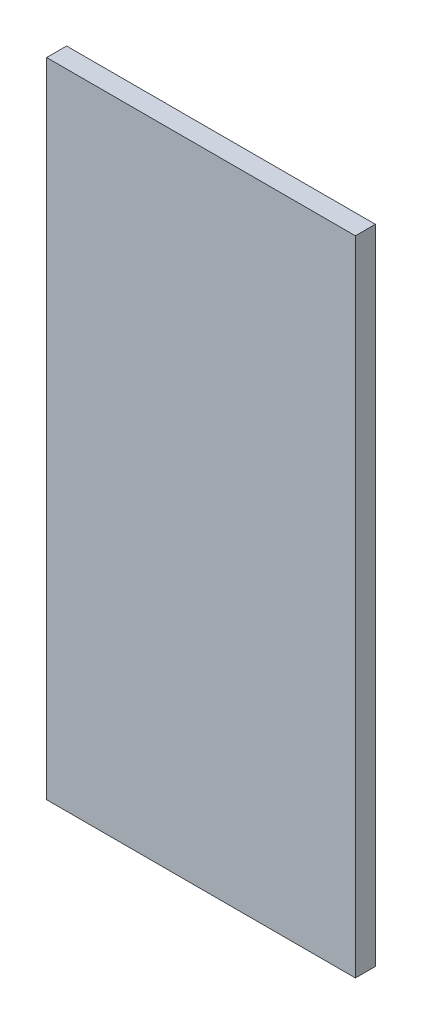
ISO-10303-21;
HEADER;
FILE_DESCRIPTION(('STEP AP214'),'2;1');
FILE_NAME('part.step','',(''),(''),'','','');
FILE_SCHEMA(('AUTOMOTIVE_DESIGN { 1 0 10303 214 1 1 1 1 }'));
ENDSEC;
DATA;
#1=APPLICATION_CONTEXT('core data for automotive mechanical design processes');
#2=APPLICATION_PROTOCOL_DEFINITION('international standard','automotive_design',2000,#1);
#3=PRODUCT_CONTEXT('',#1,'mechanical');
#4=PRODUCT('Part','Part','',(#3));
#5=PRODUCT_RELATED_PRODUCT_CATEGORY('part','',(#4));
#6=PRODUCT_DEFINITION_FORMATION('','',#4);
#7=PRODUCT_DEFINITION_CONTEXT('part definition',#1,'design');
#8=PRODUCT_DEFINITION('design','',#6,#7);
#9=PRODUCT_DEFINITION_SHAPE('','',#8);
#10=(LENGTH_UNIT() NAMED_UNIT(*) SI_UNIT(.MILLI.,.METRE.));
#11=(NAMED_UNIT(*) PLANE_ANGLE_UNIT() SI_UNIT($,.RADIAN.));
#12=(NAMED_UNIT(*) SI_UNIT($,.STERADIAN.) SOLID_ANGLE_UNIT());
#13=UNCERTAINTY_MEASURE_WITH_UNIT(LENGTH_MEASURE(1.E-05),#10,'distance_accuracy_value','');
#14=(GEOMETRIC_REPRESENTATION_CONTEXT(3) GLOBAL_UNCERTAINTY_ASSIGNED_CONTEXT((#13)) GLOBAL_UNIT_ASSIGNED_CONTEXT((#10,
#11,#12)) REPRESENTATION_CONTEXT('',''));
#15=CARTESIAN_POINT('',(0.,0.,0.));
#16=DIRECTION('',(0.,0.,1.));
#17=DIRECTION('',(1.,0.,0.));
#18=AXIS2_PLACEMENT_3D('',#15,#16,#17);
#19=CARTESIAN_POINT('',(87.0419998168945,100.66300201416,0.));
#20=DIRECTION('',(1.,0.,0.));
#21=DIRECTION('',(0.,-1.,0.));
#22=AXIS2_PLACEMENT_3D('',#19,#20,#21);
#23=PLANE('',#22);
#24=DIRECTION('',(0.,-1.,0.));
#25=VECTOR('',#24,1.);
#26=CARTESIAN_POINT('',(87.0419998168945,100.66300201416,0.03556));
#27=LINE('',#26,#25);
#28=CARTESIAN_POINT('',(87.0419998168945,100.66300201416,0.03556));
#29=VERTEX_POINT('',#28);
#30=CARTESIAN_POINT('',(87.0419998168945,99.5179977416992,0.03556));
#31=VERTEX_POINT('',#30);
#32=EDGE_CURVE('E11',#29,#31,#27,.T.);
#33=ORIENTED_EDGE('',*,*,#32,.F.);
#34=DIRECTION('',(0.,0.,1.));
#35=VECTOR('',#34,1.);
#36=CARTESIAN_POINT('',(87.0419998168945,100.66300201416,0.));
#37=LINE('',#36,#35);
#38=CARTESIAN_POINT('',(87.0419998168945,100.66300201416,0.));
#39=VERTEX_POINT('',#38);
#40=EDGE_CURVE('E24',#39,#29,#37,.T.);
#41=ORIENTED_EDGE('',*,*,#40,.F.);
#42=DIRECTION('',(0.,-1.,0.));
#43=VECTOR('',#42,1.);
#44=CARTESIAN_POINT('',(87.0419998168945,100.66300201416,0.));
#45=LINE('',#44,#43);
#46=CARTESIAN_POINT('',(87.0419998168945,99.5179977416992,0.));
#47=VERTEX_POINT('',#46);
#48=EDGE_CURVE('E75',#39,#47,#45,.T.);
#49=ORIENTED_EDGE('',*,*,#48,.T.);
#50=DIRECTION('',(0.,0.,1.));
#51=VECTOR('',#50,1.);
#52=CARTESIAN_POINT('',(87.0419998168945,99.5179977416992,0.));
#53=LINE('',#52,#51);
#54=EDGE_CURVE('E37',#47,#31,#53,.T.);
#55=ORIENTED_EDGE('',*,*,#54,.T.);
#56=EDGE_LOOP('',(#33,#41,#49,#55));
#57=FACE_BOUND('',#56,.T.);
#58=ADVANCED_FACE('F17',(#57),#23,.F.);
#59=CARTESIAN_POINT('',(87.0419998168945,99.5179977416992,0.));
#60=DIRECTION('',(0.,1.,0.));
#61=DIRECTION('',(1.,0.,0.));
#62=AXIS2_PLACEMENT_3D('',#59,#60,#61);
#63=PLANE('',#62);
#64=DIRECTION('',(1.,0.,0.));
#65=VECTOR('',#64,1.);
#66=CARTESIAN_POINT('',(87.0419998168945,99.5179977416992,0.03556));
#67=LINE('',#66,#65);
#68=CARTESIAN_POINT('',(87.5920028686523,99.5179977416992,0.03556));
#69=VERTEX_POINT('',#68);
#70=EDGE_CURVE('E83',#31,#69,#67,.T.);
#71=ORIENTED_EDGE('',*,*,#70,.F.);
#72=ORIENTED_EDGE('',*,*,#54,.F.);
#73=DIRECTION('',(1.,0.,0.));
#74=VECTOR('',#73,1.);
#75=CARTESIAN_POINT('',(87.0419998168945,99.5179977416992,0.));
#76=LINE('',#75,#74);
#77=CARTESIAN_POINT('',(87.5920028686523,99.5179977416992,0.));
#78=VERTEX_POINT('',#77);
#79=EDGE_CURVE('E81',#47,#78,#76,.T.);
#80=ORIENTED_EDGE('',*,*,#79,.T.);
#81=DIRECTION('',(0.,0.,1.));
#82=VECTOR('',#81,1.);
#83=CARTESIAN_POINT('',(87.5920028686523,99.5179977416992,0.));
#84=LINE('',#83,#82);
#85=EDGE_CURVE('E67',#78,#69,#84,.T.);
#86=ORIENTED_EDGE('',*,*,#85,.T.);
#87=EDGE_LOOP('',(#71,#72,#80,#86));
#88=FACE_BOUND('',#87,.T.);
#89=ADVANCED_FACE('F89',(#88),#63,.F.);
#90=CARTESIAN_POINT('',(87.5920028686523,99.5179977416992,0.));
#91=DIRECTION('',(-1.,0.,0.));
#92=DIRECTION('',(0.,1.,0.));
#93=AXIS2_PLACEMENT_3D('',#90,#91,#92);
#94=PLANE('',#93);
#95=DIRECTION('',(0.,1.,0.));
#96=VECTOR('',#95,1.);
#97=CARTESIAN_POINT('',(87.5920028686523,99.5179977416992,0.03556));
#98=LINE('',#97,#96);
#99=CARTESIAN_POINT('',(87.5920028686523,100.66300201416,0.03556));
#100=VERTEX_POINT('',#99);
#101=EDGE_CURVE('E71',#69,#100,#98,.T.);
#102=ORIENTED_EDGE('',*,*,#101,.F.);
#103=ORIENTED_EDGE('',*,*,#85,.F.);
#104=DIRECTION('',(0.,1.,0.));
#105=VECTOR('',#104,1.);
#106=CARTESIAN_POINT('',(87.5920028686523,99.5179977416992,0.));
#107=LINE('',#106,#105);
#108=CARTESIAN_POINT('',(87.5920028686523,100.66300201416,0.));
#109=VERTEX_POINT('',#108);
#110=EDGE_CURVE('E63',#78,#109,#107,.T.);
#111=ORIENTED_EDGE('',*,*,#110,.T.);
#112=DIRECTION('',(0.,0.,1.));
#113=VECTOR('',#112,1.);
#114=CARTESIAN_POINT('',(87.5920028686523,100.66300201416,0.));
#115=LINE('',#114,#113);
#116=EDGE_CURVE('E53',#109,#100,#115,.T.);
#117=ORIENTED_EDGE('',*,*,#116,.T.);
#118=EDGE_LOOP('',(#102,#103,#111,#117));
#119=FACE_BOUND('',#118,.T.);
#120=ADVANCED_FACE('F66',(#119),#94,.F.);
#121=CARTESIAN_POINT('',(87.5920028686523,100.66300201416,0.));
#122=DIRECTION('',(0.,-1.,0.));
#123=DIRECTION('',(-1.,0.,0.));
#124=AXIS2_PLACEMENT_3D('',#121,#122,#123);
#125=PLANE('',#124);
#126=DIRECTION('',(-1.,0.,0.));
#127=VECTOR('',#126,1.);
#128=CARTESIAN_POINT('',(87.5920028686523,100.66300201416,0.03556));
#129=LINE('',#128,#127);
#130=EDGE_CURVE('E59',#100,#29,#129,.T.);
#131=ORIENTED_EDGE('',*,*,#130,.F.);
#132=ORIENTED_EDGE('',*,*,#116,.F.);
#133=DIRECTION('',(-1.,0.,0.));
#134=VECTOR('',#133,1.);
#135=CARTESIAN_POINT('',(87.5920028686523,100.66300201416,0.));
#136=LINE('',#135,#134);
#137=EDGE_CURVE('E57',#109,#39,#136,.T.);
#138=ORIENTED_EDGE('',*,*,#137,.T.);
#139=ORIENTED_EDGE('',*,*,#40,.T.);
#140=EDGE_LOOP('',(#131,#132,#138,#139));
#141=FACE_BOUND('',#140,.T.);
#142=ADVANCED_FACE('F55',(#141),#125,.F.);
#143=CARTESIAN_POINT('',(87.0419998168945,100.66300201416,0.));
#144=DIRECTION('',(0.,0.,-1.));
#145=DIRECTION('',(-1.,0.,0.));
#146=AXIS2_PLACEMENT_3D('',#143,#144,#145);
#147=PLANE('',#146);
#148=ORIENTED_EDGE('',*,*,#137,.F.);
#149=ORIENTED_EDGE('',*,*,#110,.F.);
#150=ORIENTED_EDGE('',*,*,#79,.F.);
#151=ORIENTED_EDGE('',*,*,#48,.F.);
#152=EDGE_LOOP('',(#148,#149,#150,#151));
#153=FACE_BOUND('',#152,.T.);
#154=ADVANCED_FACE('F74',(#153),#147,.T.);
#155=CARTESIAN_POINT('',(87.0419998168945,100.66300201416,0.03556));
#156=DIRECTION('',(0.,0.,-1.));
#157=DIRECTION('',(-1.,0.,0.));
#158=AXIS2_PLACEMENT_3D('',#155,#156,#157);
#159=PLANE('',#158);
#160=ORIENTED_EDGE('',*,*,#32,.T.);
#161=ORIENTED_EDGE('',*,*,#70,.T.);
#162=ORIENTED_EDGE('',*,*,#101,.T.);
#163=ORIENTED_EDGE('',*,*,#130,.T.);
#164=EDGE_LOOP('',(#160,#161,#162,#163));
#165=FACE_BOUND('',#164,.T.);
#166=ADVANCED_FACE('F91',(#165),#159,.F.);
#167=CLOSED_SHELL('',(#58,#89,#120,#142,#154,#166));
#168=MANIFOLD_SOLID_BREP('B1',#167);
#169=ADVANCED_BREP_SHAPE_REPRESENTATION('',(#18,#168),#14);
#170=SHAPE_DEFINITION_REPRESENTATION(#9,#169);
ENDSEC;
END-ISO-10303-21;
